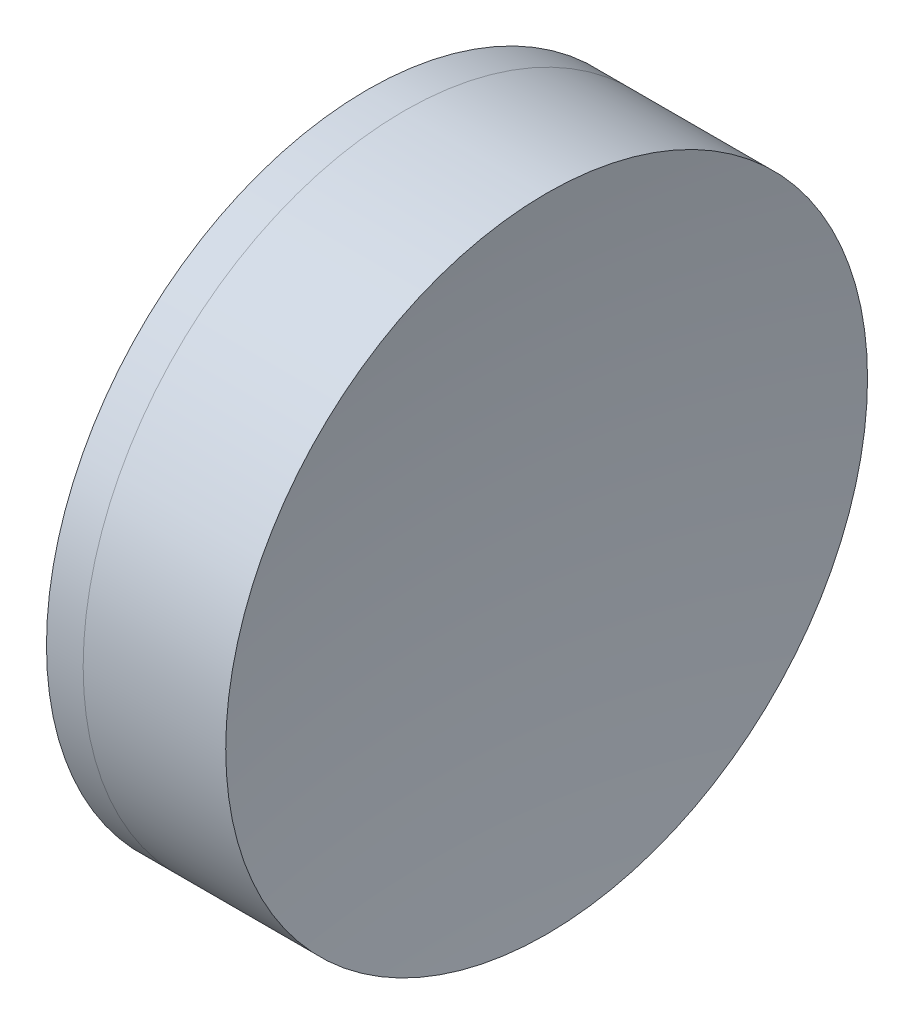
ISO-10303-21;
HEADER;
FILE_DESCRIPTION(('STEP AP214'),'2;1');
FILE_NAME('part.step','',(''),(''),'','','');
FILE_SCHEMA(('AUTOMOTIVE_DESIGN { 1 0 10303 214 1 1 1 1 }'));
ENDSEC;
DATA;
#1=APPLICATION_CONTEXT('core data for automotive mechanical design processes');
#2=APPLICATION_PROTOCOL_DEFINITION('international standard','automotive_design',2000,#1);
#3=PRODUCT_CONTEXT('',#1,'mechanical');
#4=PRODUCT('Part','Part','',(#3));
#5=PRODUCT_RELATED_PRODUCT_CATEGORY('part','',(#4));
#6=PRODUCT_DEFINITION_FORMATION('','',#4);
#7=PRODUCT_DEFINITION_CONTEXT('part definition',#1,'design');
#8=PRODUCT_DEFINITION('design','',#6,#7);
#9=PRODUCT_DEFINITION_SHAPE('','',#8);
#10=(LENGTH_UNIT() NAMED_UNIT(*) SI_UNIT(.MILLI.,.METRE.));
#11=(NAMED_UNIT(*) PLANE_ANGLE_UNIT() SI_UNIT($,.RADIAN.));
#12=(NAMED_UNIT(*) SI_UNIT($,.STERADIAN.) SOLID_ANGLE_UNIT());
#13=UNCERTAINTY_MEASURE_WITH_UNIT(LENGTH_MEASURE(1.E-05),#10,'distance_accuracy_value','');
#14=(GEOMETRIC_REPRESENTATION_CONTEXT(3) GLOBAL_UNCERTAINTY_ASSIGNED_CONTEXT((#13)) GLOBAL_UNIT_ASSIGNED_CONTEXT((#10,
#11,#12)) REPRESENTATION_CONTEXT('',''));
#15=CARTESIAN_POINT('',(0.,0.,0.));
#16=DIRECTION('',(0.,0.,1.));
#17=DIRECTION('',(1.,0.,0.));
#18=AXIS2_PLACEMENT_3D('',#15,#16,#17);
#19=CARTESIAN_POINT('',(12.4502464302757,0.,0.));
#20=DIRECTION('',(-1.,0.,0.));
#21=DIRECTION('',(0.,0.,1.));
#22=AXIS2_PLACEMENT_3D('',#19,#20,#21);
#23=SPHERICAL_SURFACE('',#22,29.38);
#24=CARTESIAN_POINT('',(38.9435361467303,0.,0.));
#25=DIRECTION('',(-1.,0.,0.));
#26=DIRECTION('',(0.,0.,1.));
#27=AXIS2_PLACEMENT_3D('',#24,#25,#26);
#28=CIRCLE('',#27,12.7);
#29=CARTESIAN_POINT('',(38.9435361467303,0.,12.7));
#30=VERTEX_POINT('',#29);
#31=EDGE_CURVE('E51',#30,#30,#28,.T.);
#32=ORIENTED_EDGE('',*,*,#31,.T.);
#33=EDGE_LOOP('',(#32));
#34=FACE_BOUND('',#33,.T.);
#35=ADVANCED_FACE('F45',(#34),#23,.F.);
#36=CARTESIAN_POINT('',(128.550246430276,0.,0.));
#37=DIRECTION('',(-1.,0.,0.));
#38=DIRECTION('',(0.,0.,-1.));
#39=AXIS2_PLACEMENT_3D('',#36,#37,#38);
#40=SPHERICAL_SURFACE('',#39,84.92);
#41=CARTESIAN_POINT('',(44.5852751624905,0.,0.));
#42=DIRECTION('',(-1.,0.,0.));
#43=DIRECTION('',(0.,0.,1.));
#44=AXIS2_PLACEMENT_3D('',#41,#42,#43);
#45=CIRCLE('',#44,12.7);
#46=CARTESIAN_POINT('',(44.5852751624905,0.,12.7));
#47=VERTEX_POINT('',#46);
#48=EDGE_CURVE('E11',#47,#47,#45,.T.);
#49=ORIENTED_EDGE('',*,*,#48,.F.);
#50=EDGE_LOOP('',(#49));
#51=FACE_BOUND('',#50,.T.);
#52=ADVANCED_FACE('F60',(#51),#40,.F.);
#53=CARTESIAN_POINT('',(-0.551919992657797,0.,0.));
#54=DIRECTION('',(-1.,0.,0.));
#55=DIRECTION('',(0.,0.,1.));
#56=AXIS2_PLACEMENT_3D('',#53,#54,#55);
#57=CYLINDRICAL_SURFACE('',#56,12.7);
#58=ORIENTED_EDGE('',*,*,#48,.T.);
#59=EDGE_LOOP('',(#58));
#60=FACE_BOUND('',#59,.T.);
#61=ORIENTED_EDGE('',*,*,#31,.F.);
#62=EDGE_LOOP('',(#61));
#63=FACE_BOUND('',#62,.T.);
#64=ADVANCED_FACE('F58',(#60,#63),#57,.T.);
#65=CLOSED_SHELL('',(#35,#52,#64));
#66=MANIFOLD_SOLID_BREP('B2',#65);
#67=CARTESIAN_POINT('',(60.5902464302757,0.,0.));
#68=DIRECTION('',(-1.,0.,0.));
#69=DIRECTION('',(0.,0.,-1.));
#70=AXIS2_PLACEMENT_3D('',#67,#68,#69);
#71=SPHERICAL_SURFACE('',#70,26.36);
#72=CARTESIAN_POINT('',(37.4913373651272,0.,0.));
#73=DIRECTION('',(-1.,0.,0.));
#74=DIRECTION('',(0.,0.,1.));
#75=AXIS2_PLACEMENT_3D('',#72,#73,#74);
#76=CIRCLE('',#75,12.7);
#77=CARTESIAN_POINT('',(37.4913373651272,0.,12.7));
#78=VERTEX_POINT('',#77);
#79=EDGE_CURVE('E44',#78,#78,#76,.T.);
#80=ORIENTED_EDGE('',*,*,#79,.T.);
#81=EDGE_LOOP('',(#80));
#82=FACE_BOUND('',#81,.T.);
#83=ADVANCED_FACE('F86',(#82),#71,.T.);
#84=CARTESIAN_POINT('',(-0.816062176165804,0.,0.));
#85=DIRECTION('',(-1.,0.,0.));
#86=DIRECTION('',(0.,0.,1.));
#87=AXIS2_PLACEMENT_3D('',#84,#85,#86);
#88=CYLINDRICAL_SURFACE('',#87,12.7);
#89=CARTESIAN_POINT('',(38.9435361467303,0.,0.));
#90=DIRECTION('',(-1.,0.,0.));
#91=DIRECTION('',(0.,0.,1.));
#92=AXIS2_PLACEMENT_3D('',#89,#90,#91);
#93=CIRCLE('',#92,12.7);
#94=CARTESIAN_POINT('',(38.9435361467303,0.,12.7));
#95=VERTEX_POINT('',#94);
#96=EDGE_CURVE('E92',#95,#95,#93,.T.);
#97=ORIENTED_EDGE('',*,*,#96,.T.);
#98=EDGE_LOOP('',(#97));
#99=FACE_BOUND('',#98,.T.);
#100=ORIENTED_EDGE('',*,*,#79,.F.);
#101=EDGE_LOOP('',(#100));
#102=FACE_BOUND('',#101,.T.);
#103=ADVANCED_FACE('F98',(#99,#102),#88,.T.);
#104=CARTESIAN_POINT('',(12.4502464302757,0.,0.));
#105=DIRECTION('',(-1.,0.,0.));
#106=DIRECTION('',(0.,0.,1.));
#107=AXIS2_PLACEMENT_3D('',#104,#105,#106);
#108=SPHERICAL_SURFACE('',#107,29.38);
#109=ORIENTED_EDGE('',*,*,#96,.F.);
#110=EDGE_LOOP('',(#109));
#111=FACE_BOUND('',#110,.T.);
#112=ADVANCED_FACE('F101',(#111),#108,.T.);
#113=CLOSED_SHELL('',(#83,#103,#112));
#114=MANIFOLD_SOLID_BREP('B6',#113);
#115=ADVANCED_BREP_SHAPE_REPRESENTATION('',(#18,#66,#114),#14);
#116=SHAPE_DEFINITION_REPRESENTATION(#9,#115);
ENDSEC;
END-ISO-10303-21;
